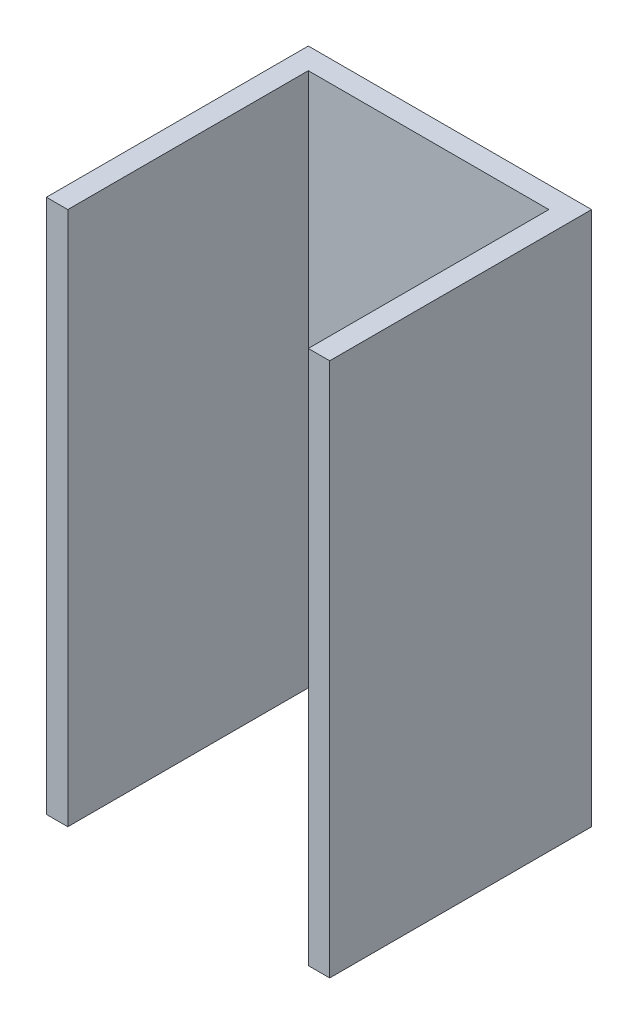
ISO-10303-21;
HEADER;
FILE_DESCRIPTION(('STEP AP214'),'2;1');
FILE_NAME('part.step','',(''),(''),'','','');
FILE_SCHEMA(('AUTOMOTIVE_DESIGN { 1 0 10303 214 1 1 1 1 }'));
ENDSEC;
DATA;
#1=APPLICATION_CONTEXT('core data for automotive mechanical design processes');
#2=APPLICATION_PROTOCOL_DEFINITION('international standard','automotive_design',2000,#1);
#3=PRODUCT_CONTEXT('',#1,'mechanical');
#4=PRODUCT('Part','Part','',(#3));
#5=PRODUCT_RELATED_PRODUCT_CATEGORY('part','',(#4));
#6=PRODUCT_DEFINITION_FORMATION('','',#4);
#7=PRODUCT_DEFINITION_CONTEXT('part definition',#1,'design');
#8=PRODUCT_DEFINITION('design','',#6,#7);
#9=PRODUCT_DEFINITION_SHAPE('','',#8);
#10=(LENGTH_UNIT() NAMED_UNIT(*) SI_UNIT(.MILLI.,.METRE.));
#11=(NAMED_UNIT(*) PLANE_ANGLE_UNIT() SI_UNIT($,.RADIAN.));
#12=(NAMED_UNIT(*) SI_UNIT($,.STERADIAN.) SOLID_ANGLE_UNIT());
#13=UNCERTAINTY_MEASURE_WITH_UNIT(LENGTH_MEASURE(1.E-05),#10,'distance_accuracy_value','');
#14=(GEOMETRIC_REPRESENTATION_CONTEXT(3) GLOBAL_UNCERTAINTY_ASSIGNED_CONTEXT((#13)) GLOBAL_UNIT_ASSIGNED_CONTEXT((#10,
#11,#12)) REPRESENTATION_CONTEXT('',''));
#15=CARTESIAN_POINT('',(0.,0.,0.));
#16=DIRECTION('',(0.,0.,1.));
#17=DIRECTION('',(1.,0.,0.));
#18=AXIS2_PLACEMENT_3D('',#15,#16,#17);
#19=CARTESIAN_POINT('',(-11.25,50.,22.5));
#20=DIRECTION('',(-1.,0.,0.));
#21=DIRECTION('',(0.,0.,1.));
#22=AXIS2_PLACEMENT_3D('',#19,#20,#21);
#23=PLANE('',#22);
#24=DIRECTION('',(0.,0.,-1.));
#25=VECTOR('',#24,1.);
#26=CARTESIAN_POINT('',(-11.25,0.,22.5));
#27=LINE('',#26,#25);
#28=CARTESIAN_POINT('',(-11.25,0.,22.5));
#29=VERTEX_POINT('',#28);
#30=CARTESIAN_POINT('',(-11.25,0.,0.));
#31=VERTEX_POINT('',#30);
#32=EDGE_CURVE('E130',#29,#31,#27,.T.);
#33=ORIENTED_EDGE('',*,*,#32,.T.);
#34=DIRECTION('',(0.,-1.,0.));
#35=VECTOR('',#34,1.);
#36=CARTESIAN_POINT('',(-11.25,50.,0.));
#37=LINE('',#36,#35);
#38=CARTESIAN_POINT('',(-11.25,50.,0.));
#39=VERTEX_POINT('',#38);
#40=EDGE_CURVE('E11',#39,#31,#37,.T.);
#41=ORIENTED_EDGE('',*,*,#40,.F.);
#42=DIRECTION('',(0.,0.,-1.));
#43=VECTOR('',#42,1.);
#44=CARTESIAN_POINT('',(-11.25,50.,22.5));
#45=LINE('',#44,#43);
#46=CARTESIAN_POINT('',(-11.25,50.,22.5));
#47=VERTEX_POINT('',#46);
#48=EDGE_CURVE('E144',#47,#39,#45,.T.);
#49=ORIENTED_EDGE('',*,*,#48,.F.);
#50=DIRECTION('',(0.,-1.,0.));
#51=VECTOR('',#50,1.);
#52=CARTESIAN_POINT('',(-11.25,50.,22.5));
#53=LINE('',#52,#51);
#54=EDGE_CURVE('E126',#47,#29,#53,.T.);
#55=ORIENTED_EDGE('',*,*,#54,.T.);
#56=EDGE_LOOP('',(#33,#41,#49,#55));
#57=FACE_BOUND('',#56,.T.);
#58=ADVANCED_FACE('F34',(#57),#23,.F.);
#59=CARTESIAN_POINT('',(-11.25,50.,0.));
#60=DIRECTION('',(0.,0.,-1.));
#61=DIRECTION('',(-1.,0.,0.));
#62=AXIS2_PLACEMENT_3D('',#59,#60,#61);
#63=PLANE('',#62);
#64=DIRECTION('',(1.,0.,0.));
#65=VECTOR('',#64,1.);
#66=CARTESIAN_POINT('',(-11.25,0.,0.));
#67=LINE('',#66,#65);
#68=CARTESIAN_POINT('',(11.25,0.,0.));
#69=VERTEX_POINT('',#68);
#70=EDGE_CURVE('E133',#31,#69,#67,.T.);
#71=ORIENTED_EDGE('',*,*,#70,.T.);
#72=DIRECTION('',(0.,-1.,0.));
#73=VECTOR('',#72,1.);
#74=CARTESIAN_POINT('',(11.25,50.,0.));
#75=LINE('',#74,#73);
#76=CARTESIAN_POINT('',(11.25,50.,0.));
#77=VERTEX_POINT('',#76);
#78=EDGE_CURVE('E42',#77,#69,#75,.T.);
#79=ORIENTED_EDGE('',*,*,#78,.F.);
#80=DIRECTION('',(1.,0.,0.));
#81=VECTOR('',#80,1.);
#82=CARTESIAN_POINT('',(-11.25,50.,0.));
#83=LINE('',#82,#81);
#84=EDGE_CURVE('E93',#39,#77,#83,.T.);
#85=ORIENTED_EDGE('',*,*,#84,.F.);
#86=ORIENTED_EDGE('',*,*,#40,.T.);
#87=EDGE_LOOP('',(#71,#79,#85,#86));
#88=FACE_BOUND('',#87,.T.);
#89=ADVANCED_FACE('F179',(#88),#63,.F.);
#90=CARTESIAN_POINT('',(11.25,50.,0.));
#91=DIRECTION('',(1.,0.,0.));
#92=DIRECTION('',(0.,0.,-1.));
#93=AXIS2_PLACEMENT_3D('',#90,#91,#92);
#94=PLANE('',#93);
#95=DIRECTION('',(0.,0.,1.));
#96=VECTOR('',#95,1.);
#97=CARTESIAN_POINT('',(11.25,0.,0.));
#98=LINE('',#97,#96);
#99=CARTESIAN_POINT('',(11.25,0.,22.5));
#100=VERTEX_POINT('',#99);
#101=EDGE_CURVE('E135',#69,#100,#98,.T.);
#102=ORIENTED_EDGE('',*,*,#101,.T.);
#103=DIRECTION('',(0.,-1.,0.));
#104=VECTOR('',#103,1.);
#105=CARTESIAN_POINT('',(11.25,50.,22.5));
#106=LINE('',#105,#104);
#107=CARTESIAN_POINT('',(11.25,50.,22.5));
#108=VERTEX_POINT('',#107);
#109=EDGE_CURVE('E151',#108,#100,#106,.T.);
#110=ORIENTED_EDGE('',*,*,#109,.F.);
#111=DIRECTION('',(0.,0.,1.));
#112=VECTOR('',#111,1.);
#113=CARTESIAN_POINT('',(11.25,50.,0.));
#114=LINE('',#113,#112);
#115=EDGE_CURVE('E159',#77,#108,#114,.T.);
#116=ORIENTED_EDGE('',*,*,#115,.F.);
#117=ORIENTED_EDGE('',*,*,#78,.T.);
#118=EDGE_LOOP('',(#102,#110,#116,#117));
#119=FACE_BOUND('',#118,.T.);
#120=ADVANCED_FACE('F157',(#119),#94,.F.);
#121=CARTESIAN_POINT('',(11.25,50.,22.5));
#122=DIRECTION('',(0.,0.,-1.));
#123=DIRECTION('',(-1.,0.,0.));
#124=AXIS2_PLACEMENT_3D('',#121,#122,#123);
#125=PLANE('',#124);
#126=DIRECTION('',(1.,0.,0.));
#127=VECTOR('',#126,1.);
#128=CARTESIAN_POINT('',(11.25,0.,22.5));
#129=LINE('',#128,#127);
#130=CARTESIAN_POINT('',(13.25,0.,22.5));
#131=VERTEX_POINT('',#130);
#132=EDGE_CURVE('E137',#100,#131,#129,.T.);
#133=ORIENTED_EDGE('',*,*,#132,.T.);
#134=DIRECTION('',(0.,-1.,0.));
#135=VECTOR('',#134,1.);
#136=CARTESIAN_POINT('',(13.25,50.,22.5));
#137=LINE('',#136,#135);
#138=CARTESIAN_POINT('',(13.25,50.,22.5));
#139=VERTEX_POINT('',#138);
#140=EDGE_CURVE('E148',#139,#131,#137,.T.);
#141=ORIENTED_EDGE('',*,*,#140,.F.);
#142=DIRECTION('',(1.,0.,0.));
#143=VECTOR('',#142,1.);
#144=CARTESIAN_POINT('',(11.25,50.,22.5));
#145=LINE('',#144,#143);
#146=EDGE_CURVE('E171',#108,#139,#145,.T.);
#147=ORIENTED_EDGE('',*,*,#146,.F.);
#148=ORIENTED_EDGE('',*,*,#109,.T.);
#149=EDGE_LOOP('',(#133,#141,#147,#148));
#150=FACE_BOUND('',#149,.T.);
#151=ADVANCED_FACE('F167',(#150),#125,.F.);
#152=CARTESIAN_POINT('',(13.25,50.,22.5));
#153=DIRECTION('',(-1.,0.,0.));
#154=DIRECTION('',(0.,0.,1.));
#155=AXIS2_PLACEMENT_3D('',#152,#153,#154);
#156=PLANE('',#155);
#157=DIRECTION('',(0.,0.,-1.));
#158=VECTOR('',#157,1.);
#159=CARTESIAN_POINT('',(13.25,0.,22.5));
#160=LINE('',#159,#158);
#161=CARTESIAN_POINT('',(13.25,0.,-2.));
#162=VERTEX_POINT('',#161);
#163=EDGE_CURVE('E139',#131,#162,#160,.T.);
#164=ORIENTED_EDGE('',*,*,#163,.T.);
#165=DIRECTION('',(0.,-1.,0.));
#166=VECTOR('',#165,1.);
#167=CARTESIAN_POINT('',(13.25,50.,-2.));
#168=LINE('',#167,#166);
#169=CARTESIAN_POINT('',(13.25,50.,-2.));
#170=VERTEX_POINT('',#169);
#171=EDGE_CURVE('E121',#170,#162,#168,.T.);
#172=ORIENTED_EDGE('',*,*,#171,.F.);
#173=DIRECTION('',(0.,0.,-1.));
#174=VECTOR('',#173,1.);
#175=CARTESIAN_POINT('',(13.25,50.,22.5));
#176=LINE('',#175,#174);
#177=EDGE_CURVE('E112',#139,#170,#176,.T.);
#178=ORIENTED_EDGE('',*,*,#177,.F.);
#179=ORIENTED_EDGE('',*,*,#140,.T.);
#180=EDGE_LOOP('',(#164,#172,#178,#179));
#181=FACE_BOUND('',#180,.T.);
#182=ADVANCED_FACE('F170',(#181),#156,.F.);
#183=CARTESIAN_POINT('',(13.25,50.,-2.));
#184=DIRECTION('',(0.,0.,1.));
#185=DIRECTION('',(1.,0.,0.));
#186=AXIS2_PLACEMENT_3D('',#183,#184,#185);
#187=PLANE('',#186);
#188=DIRECTION('',(-1.,0.,0.));
#189=VECTOR('',#188,1.);
#190=CARTESIAN_POINT('',(13.25,0.,-2.));
#191=LINE('',#190,#189);
#192=CARTESIAN_POINT('',(-13.25,0.,-2.));
#193=VERTEX_POINT('',#192);
#194=EDGE_CURVE('E120',#162,#193,#191,.T.);
#195=ORIENTED_EDGE('',*,*,#194,.T.);
#196=DIRECTION('',(0.,-1.,0.));
#197=VECTOR('',#196,1.);
#198=CARTESIAN_POINT('',(-13.25,50.,-2.));
#199=LINE('',#198,#197);
#200=CARTESIAN_POINT('',(-13.25,50.,-2.));
#201=VERTEX_POINT('',#200);
#202=EDGE_CURVE('E117',#201,#193,#199,.T.);
#203=ORIENTED_EDGE('',*,*,#202,.F.);
#204=DIRECTION('',(-1.,0.,0.));
#205=VECTOR('',#204,1.);
#206=CARTESIAN_POINT('',(13.25,50.,-2.));
#207=LINE('',#206,#205);
#208=EDGE_CURVE('E106',#170,#201,#207,.T.);
#209=ORIENTED_EDGE('',*,*,#208,.F.);
#210=ORIENTED_EDGE('',*,*,#171,.T.);
#211=EDGE_LOOP('',(#195,#203,#209,#210));
#212=FACE_BOUND('',#211,.T.);
#213=ADVANCED_FACE('F118',(#212),#187,.F.);
#214=CARTESIAN_POINT('',(-13.25,50.,-2.));
#215=DIRECTION('',(1.,0.,0.));
#216=DIRECTION('',(0.,0.,-1.));
#217=AXIS2_PLACEMENT_3D('',#214,#215,#216);
#218=PLANE('',#217);
#219=DIRECTION('',(0.,0.,1.));
#220=VECTOR('',#219,1.);
#221=CARTESIAN_POINT('',(-13.25,0.,-2.));
#222=LINE('',#221,#220);
#223=CARTESIAN_POINT('',(-13.25,0.,22.5));
#224=VERTEX_POINT('',#223);
#225=EDGE_CURVE('E79',#193,#224,#222,.T.);
#226=ORIENTED_EDGE('',*,*,#225,.T.);
#227=DIRECTION('',(0.,-1.,0.));
#228=VECTOR('',#227,1.);
#229=CARTESIAN_POINT('',(-13.25,50.,22.5));
#230=LINE('',#229,#228);
#231=CARTESIAN_POINT('',(-13.25,50.,22.5));
#232=VERTEX_POINT('',#231);
#233=EDGE_CURVE('E122',#232,#224,#230,.T.);
#234=ORIENTED_EDGE('',*,*,#233,.F.);
#235=DIRECTION('',(0.,0.,1.));
#236=VECTOR('',#235,1.);
#237=CARTESIAN_POINT('',(-13.25,50.,-2.));
#238=LINE('',#237,#236);
#239=EDGE_CURVE('E110',#201,#232,#238,.T.);
#240=ORIENTED_EDGE('',*,*,#239,.F.);
#241=ORIENTED_EDGE('',*,*,#202,.T.);
#242=EDGE_LOOP('',(#226,#234,#240,#241));
#243=FACE_BOUND('',#242,.T.);
#244=ADVANCED_FACE('F124',(#243),#218,.F.);
#245=CARTESIAN_POINT('',(-13.25,50.,22.5));
#246=DIRECTION('',(0.,0.,-1.));
#247=DIRECTION('',(-1.,0.,0.));
#248=AXIS2_PLACEMENT_3D('',#245,#246,#247);
#249=PLANE('',#248);
#250=DIRECTION('',(1.,0.,0.));
#251=VECTOR('',#250,1.);
#252=CARTESIAN_POINT('',(-13.25,0.,22.5));
#253=LINE('',#252,#251);
#254=EDGE_CURVE('E85',#224,#29,#253,.T.);
#255=ORIENTED_EDGE('',*,*,#254,.T.);
#256=ORIENTED_EDGE('',*,*,#54,.F.);
#257=DIRECTION('',(1.,0.,0.));
#258=VECTOR('',#257,1.);
#259=CARTESIAN_POINT('',(-13.25,50.,22.5));
#260=LINE('',#259,#258);
#261=EDGE_CURVE('E50',#232,#47,#260,.T.);
#262=ORIENTED_EDGE('',*,*,#261,.F.);
#263=ORIENTED_EDGE('',*,*,#233,.T.);
#264=EDGE_LOOP('',(#255,#256,#262,#263));
#265=FACE_BOUND('',#264,.T.);
#266=ADVANCED_FACE('F195',(#265),#249,.F.);
#267=CARTESIAN_POINT('',(0.,50.,0.));
#268=DIRECTION('',(0.,-1.,0.));
#269=DIRECTION('',(0.,0.,-1.));
#270=AXIS2_PLACEMENT_3D('',#267,#268,#269);
#271=PLANE('',#270);
#272=ORIENTED_EDGE('',*,*,#48,.T.);
#273=ORIENTED_EDGE('',*,*,#84,.T.);
#274=ORIENTED_EDGE('',*,*,#115,.T.);
#275=ORIENTED_EDGE('',*,*,#146,.T.);
#276=ORIENTED_EDGE('',*,*,#177,.T.);
#277=ORIENTED_EDGE('',*,*,#208,.T.);
#278=ORIENTED_EDGE('',*,*,#239,.T.);
#279=ORIENTED_EDGE('',*,*,#261,.T.);
#280=EDGE_LOOP('',(#272,#273,#274,#275,#276,#277,#278,#279));
#281=FACE_BOUND('',#280,.T.);
#282=ADVANCED_FACE('F108',(#281),#271,.F.);
#283=CARTESIAN_POINT('',(0.,0.,0.));
#284=DIRECTION('',(0.,-1.,0.));
#285=DIRECTION('',(0.,0.,-1.));
#286=AXIS2_PLACEMENT_3D('',#283,#284,#285);
#287=PLANE('',#286);
#288=ORIENTED_EDGE('',*,*,#32,.F.);
#289=ORIENTED_EDGE('',*,*,#254,.F.);
#290=ORIENTED_EDGE('',*,*,#225,.F.);
#291=ORIENTED_EDGE('',*,*,#194,.F.);
#292=ORIENTED_EDGE('',*,*,#163,.F.);
#293=ORIENTED_EDGE('',*,*,#132,.F.);
#294=ORIENTED_EDGE('',*,*,#101,.F.);
#295=ORIENTED_EDGE('',*,*,#70,.F.);
#296=EDGE_LOOP('',(#288,#289,#290,#291,#292,#293,#294,#295));
#297=FACE_BOUND('',#296,.T.);
#298=ADVANCED_FACE('F163',(#297),#287,.T.);
#299=CLOSED_SHELL('',(#58,#89,#120,#151,#182,#213,#244,#266,#282,#298));
#300=MANIFOLD_SOLID_BREP('B2',#299);
#301=ADVANCED_BREP_SHAPE_REPRESENTATION('',(#18,#300),#14);
#302=SHAPE_DEFINITION_REPRESENTATION(#9,#301);
ENDSEC;
END-ISO-10303-21;
